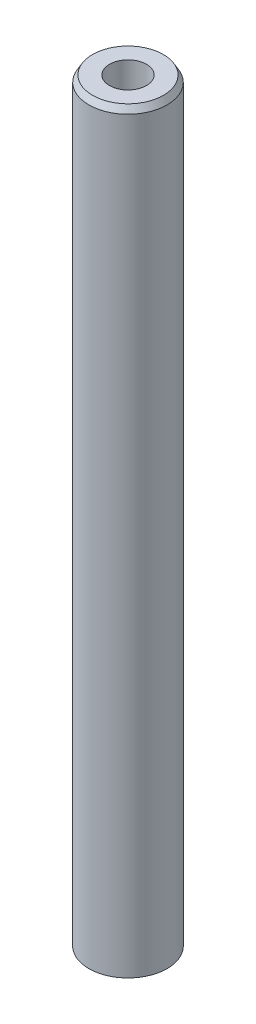
ISO-10303-21;
HEADER;
FILE_DESCRIPTION(('STEP AP214'),'2;1');
FILE_NAME('part.step','',(''),(''),'','','');
FILE_SCHEMA(('AUTOMOTIVE_DESIGN { 1 0 10303 214 1 1 1 1 }'));
ENDSEC;
DATA;
#1=APPLICATION_CONTEXT('core data for automotive mechanical design processes');
#2=APPLICATION_PROTOCOL_DEFINITION('international standard','automotive_design',2000,#1);
#3=PRODUCT_CONTEXT('',#1,'mechanical');
#4=PRODUCT('Part','Part','',(#3));
#5=PRODUCT_RELATED_PRODUCT_CATEGORY('part','',(#4));
#6=PRODUCT_DEFINITION_FORMATION('','',#4);
#7=PRODUCT_DEFINITION_CONTEXT('part definition',#1,'design');
#8=PRODUCT_DEFINITION('design','',#6,#7);
#9=PRODUCT_DEFINITION_SHAPE('','',#8);
#10=(LENGTH_UNIT() NAMED_UNIT(*) SI_UNIT(.MILLI.,.METRE.));
#11=(NAMED_UNIT(*) PLANE_ANGLE_UNIT() SI_UNIT($,.RADIAN.));
#12=(NAMED_UNIT(*) SI_UNIT($,.STERADIAN.) SOLID_ANGLE_UNIT());
#13=UNCERTAINTY_MEASURE_WITH_UNIT(LENGTH_MEASURE(1.E-05),#10,'distance_accuracy_value','');
#14=(GEOMETRIC_REPRESENTATION_CONTEXT(3) GLOBAL_UNCERTAINTY_ASSIGNED_CONTEXT((#13)) GLOBAL_UNIT_ASSIGNED_CONTEXT((#10,
#11,#12)) REPRESENTATION_CONTEXT('',''));
#15=CARTESIAN_POINT('',(0.,0.,0.));
#16=DIRECTION('',(0.,0.,1.));
#17=DIRECTION('',(1.,0.,0.));
#18=AXIS2_PLACEMENT_3D('',#15,#16,#17);
#19=CARTESIAN_POINT('',(0.,96.8891554053854,0.));
#20=DIRECTION('',(0.,-1.,0.));
#21=DIRECTION('',(0.,0.,-1.));
#22=AXIS2_PLACEMENT_3D('',#19,#20,#21);
#23=CYLINDRICAL_SURFACE('',#22,5.);
#24=CARTESIAN_POINT('',(0.,96.0684254874325,0.));
#25=DIRECTION('',(0.,1.,0.));
#26=DIRECTION('',(0.,0.,1.));
#27=AXIS2_PLACEMENT_3D('',#24,#25,#26);
#28=CIRCLE('',#27,5.);
#29=CARTESIAN_POINT('',(0.,96.0684254874325,5.));
#30=VERTEX_POINT('',#29);
#31=EDGE_CURVE('E50',#30,#30,#28,.F.);
#32=ORIENTED_EDGE('',*,*,#31,.T.);
#33=EDGE_LOOP('',(#32));
#34=FACE_BOUND('',#33,.T.);
#35=CARTESIAN_POINT('',(0.,0.473848639062011,0.));
#36=DIRECTION('',(0.,1.,0.));
#37=DIRECTION('',(0.,0.,1.));
#38=AXIS2_PLACEMENT_3D('',#35,#36,#37);
#39=CIRCLE('',#38,5.);
#40=CARTESIAN_POINT('',(0.,0.473848639062011,5.));
#41=VERTEX_POINT('',#40);
#42=EDGE_CURVE('E51',#41,#41,#39,.T.);
#43=ORIENTED_EDGE('',*,*,#42,.T.);
#44=EDGE_LOOP('',(#43));
#45=FACE_BOUND('',#44,.T.);
#46=ADVANCED_FACE('F39',(#34,#45),#23,.T.);
#47=CARTESIAN_POINT('',(0.,96.8891554053854,0.));
#48=DIRECTION('',(0.,1.,0.));
#49=DIRECTION('',(0.,0.,1.));
#50=AXIS2_PLACEMENT_3D('',#47,#48,#49);
#51=PLANE('',#50);
#52=CARTESIAN_POINT('',(0.,96.8891554053854,0.));
#53=DIRECTION('',(0.,1.,0.));
#54=DIRECTION('',(0.,0.,1.));
#55=AXIS2_PLACEMENT_3D('',#52,#53,#54);
#56=CIRCLE('',#55,4.52615136093797);
#57=CARTESIAN_POINT('',(0.,96.8891554053854,4.52615136093797));
#58=VERTEX_POINT('',#57);
#59=EDGE_CURVE('E54',#58,#58,#56,.T.);
#60=ORIENTED_EDGE('',*,*,#59,.T.);
#61=EDGE_LOOP('',(#60));
#62=FACE_BOUND('',#61,.T.);
#63=CARTESIAN_POINT('',(0.,96.8891554053854,0.));
#64=DIRECTION('',(0.,1.,0.));
#65=DIRECTION('',(0.,0.,1.));
#66=AXIS2_PLACEMENT_3D('',#63,#64,#65);
#67=CIRCLE('',#66,2.36275869187991);
#68=CARTESIAN_POINT('',(0.,96.8891554053854,2.36275869187991));
#69=VERTEX_POINT('',#68);
#70=EDGE_CURVE('E58',#69,#69,#67,.T.);
#71=ORIENTED_EDGE('',*,*,#70,.F.);
#72=EDGE_LOOP('',(#71));
#73=FACE_BOUND('',#72,.T.);
#74=ADVANCED_FACE('F69',(#62,#73),#51,.T.);
#75=CARTESIAN_POINT('',(0.,0.,0.));
#76=DIRECTION('',(0.,1.,0.));
#77=DIRECTION('',(0.,0.,1.));
#78=AXIS2_PLACEMENT_3D('',#75,#76,#77);
#79=PLANE('',#78);
#80=CARTESIAN_POINT('',(0.,0.,0.));
#81=DIRECTION('',(0.,1.,0.));
#82=DIRECTION('',(0.,0.,1.));
#83=AXIS2_PLACEMENT_3D('',#80,#81,#82);
#84=CIRCLE('',#83,4.17927008204723);
#85=CARTESIAN_POINT('',(0.,0.,4.17927008204723));
#86=VERTEX_POINT('',#85);
#87=EDGE_CURVE('E10',#86,#86,#84,.F.);
#88=ORIENTED_EDGE('',*,*,#87,.T.);
#89=EDGE_LOOP('',(#88));
#90=FACE_BOUND('',#89,.T.);
#91=CARTESIAN_POINT('',(0.,0.,0.));
#92=DIRECTION('',(0.,1.,0.));
#93=DIRECTION('',(0.,0.,1.));
#94=AXIS2_PLACEMENT_3D('',#91,#92,#93);
#95=CIRCLE('',#94,2.36275869187991);
#96=CARTESIAN_POINT('',(0.,0.,2.36275869187991));
#97=VERTEX_POINT('',#96);
#98=EDGE_CURVE('E63',#97,#97,#95,.T.);
#99=ORIENTED_EDGE('',*,*,#98,.T.);
#100=EDGE_LOOP('',(#99));
#101=FACE_BOUND('',#100,.T.);
#102=ADVANCED_FACE('F75',(#90,#101),#79,.F.);
#103=CARTESIAN_POINT('',(0.,96.8891554053854,0.));
#104=DIRECTION('',(0.,-1.,0.));
#105=DIRECTION('',(0.,0.,-1.));
#106=AXIS2_PLACEMENT_3D('',#103,#104,#105);
#107=CYLINDRICAL_SURFACE('',#106,2.36275869187991);
#108=ORIENTED_EDGE('',*,*,#70,.T.);
#109=EDGE_LOOP('',(#108));
#110=FACE_BOUND('',#109,.T.);
#111=ORIENTED_EDGE('',*,*,#98,.F.);
#112=EDGE_LOOP('',(#111));
#113=FACE_BOUND('',#112,.T.);
#114=ADVANCED_FACE('F70',(#110,#113),#107,.F.);
#115=CARTESIAN_POINT('',(0.,96.8891554053854,0.));
#116=DIRECTION('',(0.,-1.,0.));
#117=DIRECTION('',(0.,0.,-1.));
#118=AXIS2_PLACEMENT_3D('',#115,#116,#117);
#119=CONICAL_SURFACE('',#118,4.52615136093797,0.523598775598288);
#120=ORIENTED_EDGE('',*,*,#31,.F.);
#121=EDGE_LOOP('',(#120));
#122=FACE_BOUND('',#121,.T.);
#123=ORIENTED_EDGE('',*,*,#59,.F.);
#124=EDGE_LOOP('',(#123));
#125=FACE_BOUND('',#124,.T.);
#126=ADVANCED_FACE('F81',(#122,#125),#119,.T.);
#127=CARTESIAN_POINT('',(0.,0.473848639062011,0.));
#128=DIRECTION('',(0.,1.,0.));
#129=DIRECTION('',(0.,0.,1.));
#130=AXIS2_PLACEMENT_3D('',#127,#128,#129);
#131=CONICAL_SURFACE('',#130,5.,1.0471975511966);
#132=ORIENTED_EDGE('',*,*,#87,.F.);
#133=EDGE_LOOP('',(#132));
#134=FACE_BOUND('',#133,.T.);
#135=ORIENTED_EDGE('',*,*,#42,.F.);
#136=EDGE_LOOP('',(#135));
#137=FACE_BOUND('',#136,.T.);
#138=ADVANCED_FACE('F45',(#134,#137),#131,.T.);
#139=CLOSED_SHELL('',(#46,#74,#102,#114,#126,#138));
#140=MANIFOLD_SOLID_BREP('B2',#139);
#141=ADVANCED_BREP_SHAPE_REPRESENTATION('',(#18,#140),#14);
#142=SHAPE_DEFINITION_REPRESENTATION(#9,#141);
ENDSEC;
END-ISO-10303-21;
